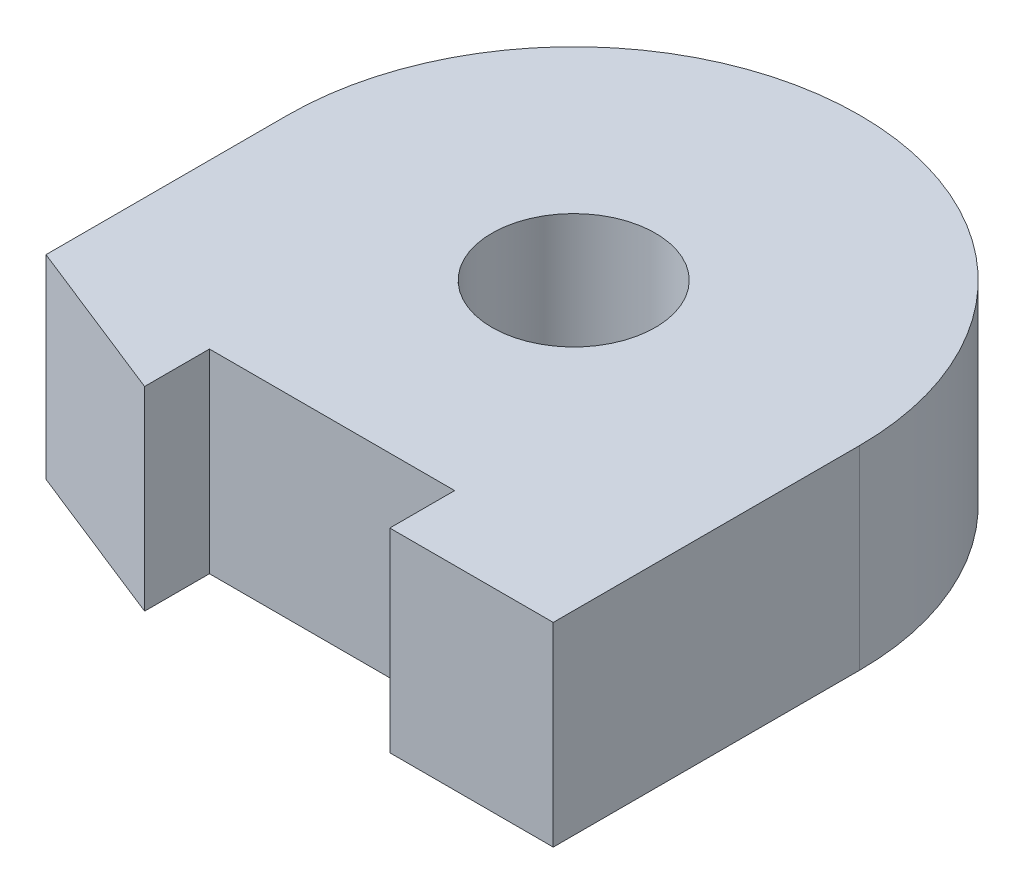
ISO-10303-21;
HEADER;
FILE_DESCRIPTION(('STEP AP214'),'2;1');
FILE_NAME('part.step','',(''),(''),'','','');
FILE_SCHEMA(('AUTOMOTIVE_DESIGN { 1 0 10303 214 1 1 1 1 }'));
ENDSEC;
DATA;
#1=APPLICATION_CONTEXT('core data for automotive mechanical design processes');
#2=APPLICATION_PROTOCOL_DEFINITION('international standard','automotive_design',2000,#1);
#3=PRODUCT_CONTEXT('',#1,'mechanical');
#4=PRODUCT('Part','Part','',(#3));
#5=PRODUCT_RELATED_PRODUCT_CATEGORY('part','',(#4));
#6=PRODUCT_DEFINITION_FORMATION('','',#4);
#7=PRODUCT_DEFINITION_CONTEXT('part definition',#1,'design');
#8=PRODUCT_DEFINITION('design','',#6,#7);
#9=PRODUCT_DEFINITION_SHAPE('','',#8);
#10=(LENGTH_UNIT() NAMED_UNIT(*) SI_UNIT(.MILLI.,.METRE.));
#11=(NAMED_UNIT(*) PLANE_ANGLE_UNIT() SI_UNIT($,.RADIAN.));
#12=(NAMED_UNIT(*) SI_UNIT($,.STERADIAN.) SOLID_ANGLE_UNIT());
#13=UNCERTAINTY_MEASURE_WITH_UNIT(LENGTH_MEASURE(1.E-05),#10,'distance_accuracy_value','');
#14=(GEOMETRIC_REPRESENTATION_CONTEXT(3) GLOBAL_UNCERTAINTY_ASSIGNED_CONTEXT((#13)) GLOBAL_UNIT_ASSIGNED_CONTEXT((#10,
#11,#12)) REPRESENTATION_CONTEXT('',''));
#15=CARTESIAN_POINT('',(0.,0.,0.));
#16=DIRECTION('',(0.,0.,1.));
#17=DIRECTION('',(1.,0.,0.));
#18=AXIS2_PLACEMENT_3D('',#15,#16,#17);
#19=CARTESIAN_POINT('',(0.,9.525,0.));
#20=DIRECTION('',(0.,0.,1.));
#21=DIRECTION('',(1.,0.,0.));
#22=AXIS2_PLACEMENT_3D('',#19,#20,#21);
#23=PLANE('',#22);
#24=DIRECTION('',(-1.,0.,0.));
#25=VECTOR('',#24,1.);
#26=CARTESIAN_POINT('',(0.,0.,0.));
#27=LINE('',#26,#25);
#28=CARTESIAN_POINT('',(6.,0.,0.));
#29=VERTEX_POINT('',#28);
#30=CARTESIAN_POINT('',(-6.,0.,0.));
#31=VERTEX_POINT('',#30);
#32=EDGE_CURVE('E136',#29,#31,#27,.T.);
#33=ORIENTED_EDGE('',*,*,#32,.F.);
#34=DIRECTION('',(0.,-1.,0.));
#35=VECTOR('',#34,1.);
#36=CARTESIAN_POINT('',(6.,9.525,0.));
#37=LINE('',#36,#35);
#38=CARTESIAN_POINT('',(6.,9.525,0.));
#39=VERTEX_POINT('',#38);
#40=EDGE_CURVE('E11',#39,#29,#37,.T.);
#41=ORIENTED_EDGE('',*,*,#40,.F.);
#42=DIRECTION('',(-1.,0.,0.));
#43=VECTOR('',#42,1.);
#44=CARTESIAN_POINT('',(0.,9.525,0.));
#45=LINE('',#44,#43);
#46=CARTESIAN_POINT('',(-6.,9.525,0.));
#47=VERTEX_POINT('',#46);
#48=EDGE_CURVE('E157',#39,#47,#45,.T.);
#49=ORIENTED_EDGE('',*,*,#48,.T.);
#50=DIRECTION('',(0.,-1.,0.));
#51=VECTOR('',#50,1.);
#52=CARTESIAN_POINT('',(-6.,9.525,0.));
#53=LINE('',#52,#51);
#54=EDGE_CURVE('E55',#47,#31,#53,.T.);
#55=ORIENTED_EDGE('',*,*,#54,.T.);
#56=EDGE_LOOP('',(#33,#41,#49,#55));
#57=FACE_BOUND('',#56,.T.);
#58=ADVANCED_FACE('F39',(#57),#23,.T.);
#59=CARTESIAN_POINT('',(6.,9.525,0.));
#60=DIRECTION('',(1.,0.,0.));
#61=DIRECTION('',(0.,0.,-1.));
#62=AXIS2_PLACEMENT_3D('',#59,#60,#61);
#63=PLANE('',#62);
#64=DIRECTION('',(0.,0.,1.));
#65=VECTOR('',#64,1.);
#66=CARTESIAN_POINT('',(6.,0.,0.));
#67=LINE('',#66,#65);
#68=CARTESIAN_POINT('',(6.,0.,3.175));
#69=VERTEX_POINT('',#68);
#70=EDGE_CURVE('E138',#29,#69,#67,.T.);
#71=ORIENTED_EDGE('',*,*,#70,.T.);
#72=DIRECTION('',(0.,-1.,0.));
#73=VECTOR('',#72,1.);
#74=CARTESIAN_POINT('',(6.,9.525,3.175));
#75=LINE('',#74,#73);
#76=CARTESIAN_POINT('',(6.,9.525,3.175));
#77=VERTEX_POINT('',#76);
#78=EDGE_CURVE('E47',#77,#69,#75,.T.);
#79=ORIENTED_EDGE('',*,*,#78,.F.);
#80=DIRECTION('',(0.,0.,1.));
#81=VECTOR('',#80,1.);
#82=CARTESIAN_POINT('',(6.,9.525,0.));
#83=LINE('',#82,#81);
#84=EDGE_CURVE('E186',#39,#77,#83,.T.);
#85=ORIENTED_EDGE('',*,*,#84,.F.);
#86=ORIENTED_EDGE('',*,*,#40,.T.);
#87=EDGE_LOOP('',(#71,#79,#85,#86));
#88=FACE_BOUND('',#87,.T.);
#89=ADVANCED_FACE('F202',(#88),#63,.F.);
#90=CARTESIAN_POINT('',(0.,9.525,3.175));
#91=DIRECTION('',(0.,0.,-1.));
#92=DIRECTION('',(-1.,0.,0.));
#93=AXIS2_PLACEMENT_3D('',#90,#91,#92);
#94=PLANE('',#93);
#95=DIRECTION('',(1.,0.,0.));
#96=VECTOR('',#95,1.);
#97=CARTESIAN_POINT('',(0.,0.,3.175));
#98=LINE('',#97,#96);
#99=CARTESIAN_POINT('',(14.,0.,3.175));
#100=VERTEX_POINT('',#99);
#101=EDGE_CURVE('E140',#69,#100,#98,.T.);
#102=ORIENTED_EDGE('',*,*,#101,.T.);
#103=DIRECTION('',(0.,-1.,0.));
#104=VECTOR('',#103,1.);
#105=CARTESIAN_POINT('',(14.,9.525,3.175));
#106=LINE('',#105,#104);
#107=CARTESIAN_POINT('',(14.,9.525,3.175));
#108=VERTEX_POINT('',#107);
#109=EDGE_CURVE('E163',#108,#100,#106,.T.);
#110=ORIENTED_EDGE('',*,*,#109,.F.);
#111=DIRECTION('',(1.,0.,0.));
#112=VECTOR('',#111,1.);
#113=CARTESIAN_POINT('',(0.,9.525,3.175));
#114=LINE('',#113,#112);
#115=EDGE_CURVE('E172',#77,#108,#114,.T.);
#116=ORIENTED_EDGE('',*,*,#115,.F.);
#117=ORIENTED_EDGE('',*,*,#78,.T.);
#118=EDGE_LOOP('',(#102,#110,#116,#117));
#119=FACE_BOUND('',#118,.T.);
#120=ADVANCED_FACE('F170',(#119),#94,.F.);
#121=CARTESIAN_POINT('',(14.,9.525,0.));
#122=DIRECTION('',(-1.,0.,0.));
#123=DIRECTION('',(0.,0.,1.));
#124=AXIS2_PLACEMENT_3D('',#121,#122,#123);
#125=PLANE('',#124);
#126=DIRECTION('',(0.,0.,-1.));
#127=VECTOR('',#126,1.);
#128=CARTESIAN_POINT('',(14.,0.,0.));
#129=LINE('',#128,#127);
#130=CARTESIAN_POINT('',(14.,0.,-11.825));
#131=VERTEX_POINT('',#130);
#132=EDGE_CURVE('E142',#100,#131,#129,.T.);
#133=ORIENTED_EDGE('',*,*,#132,.T.);
#134=DIRECTION('',(0.,-1.,0.));
#135=VECTOR('',#134,1.);
#136=CARTESIAN_POINT('',(14.,9.525,-11.825));
#137=LINE('',#136,#135);
#138=CARTESIAN_POINT('',(14.,9.525,-11.825));
#139=VERTEX_POINT('',#138);
#140=EDGE_CURVE('E161',#139,#131,#137,.T.);
#141=ORIENTED_EDGE('',*,*,#140,.F.);
#142=DIRECTION('',(0.,0.,-1.));
#143=VECTOR('',#142,1.);
#144=CARTESIAN_POINT('',(14.,9.525,0.));
#145=LINE('',#144,#143);
#146=EDGE_CURVE('E184',#108,#139,#145,.T.);
#147=ORIENTED_EDGE('',*,*,#146,.F.);
#148=ORIENTED_EDGE('',*,*,#109,.T.);
#149=EDGE_LOOP('',(#133,#141,#147,#148));
#150=FACE_BOUND('',#149,.T.);
#151=ADVANCED_FACE('F182',(#150),#125,.F.);
#152=CARTESIAN_POINT('',(0.,9.525,-11.825));
#153=DIRECTION('',(0.,-1.,0.));
#154=DIRECTION('',(0.,0.,-1.));
#155=AXIS2_PLACEMENT_3D('',#152,#153,#154);
#156=CYLINDRICAL_SURFACE('',#155,14.);
#157=CARTESIAN_POINT('',(0.,0.,-11.825));
#158=DIRECTION('',(0.,1.,0.));
#159=DIRECTION('',(0.,0.,1.));
#160=AXIS2_PLACEMENT_3D('',#157,#158,#159);
#161=CIRCLE('',#160,14.);
#162=CARTESIAN_POINT('',(-14.,0.,-11.825));
#163=VERTEX_POINT('',#162);
#164=EDGE_CURVE('E145',#163,#131,#161,.F.);
#165=ORIENTED_EDGE('',*,*,#164,.F.);
#166=DIRECTION('',(0.,-1.,0.));
#167=VECTOR('',#166,1.);
#168=CARTESIAN_POINT('',(-14.,9.525,-11.825));
#169=LINE('',#168,#167);
#170=CARTESIAN_POINT('',(-14.,9.525,-11.825));
#171=VERTEX_POINT('',#170);
#172=EDGE_CURVE('E114',#171,#163,#169,.T.);
#173=ORIENTED_EDGE('',*,*,#172,.F.);
#174=CARTESIAN_POINT('',(0.,9.525,-11.825));
#175=DIRECTION('',(0.,1.,0.));
#176=DIRECTION('',(0.,0.,1.));
#177=AXIS2_PLACEMENT_3D('',#174,#175,#176);
#178=CIRCLE('',#177,14.);
#179=EDGE_CURVE('E125',#171,#139,#178,.F.);
#180=ORIENTED_EDGE('',*,*,#179,.T.);
#181=ORIENTED_EDGE('',*,*,#140,.T.);
#182=EDGE_LOOP('',(#165,#173,#180,#181));
#183=FACE_BOUND('',#182,.T.);
#184=ADVANCED_FACE('F213',(#183),#156,.T.);
#185=CARTESIAN_POINT('',(-14.,9.525,0.));
#186=DIRECTION('',(-1.,0.,0.));
#187=DIRECTION('',(0.,0.,1.));
#188=AXIS2_PLACEMENT_3D('',#185,#186,#187);
#189=PLANE('',#188);
#190=DIRECTION('',(0.,0.,-1.));
#191=VECTOR('',#190,1.);
#192=CARTESIAN_POINT('',(-14.,0.,0.));
#193=LINE('',#192,#191);
#194=CARTESIAN_POINT('',(-14.,0.,0.));
#195=VERTEX_POINT('',#194);
#196=EDGE_CURVE('E110',#195,#163,#193,.T.);
#197=ORIENTED_EDGE('',*,*,#196,.F.);
#198=DIRECTION('',(0.,-1.,0.));
#199=VECTOR('',#198,1.);
#200=CARTESIAN_POINT('',(-14.,9.525,0.));
#201=LINE('',#200,#199);
#202=CARTESIAN_POINT('',(-14.,9.525,0.));
#203=VERTEX_POINT('',#202);
#204=EDGE_CURVE('E105',#203,#195,#201,.T.);
#205=ORIENTED_EDGE('',*,*,#204,.F.);
#206=DIRECTION('',(0.,0.,-1.));
#207=VECTOR('',#206,1.);
#208=CARTESIAN_POINT('',(-14.,9.525,0.));
#209=LINE('',#208,#207);
#210=EDGE_CURVE('E108',#203,#171,#209,.T.);
#211=ORIENTED_EDGE('',*,*,#210,.T.);
#212=ORIENTED_EDGE('',*,*,#172,.T.);
#213=EDGE_LOOP('',(#197,#205,#211,#212));
#214=FACE_BOUND('',#213,.T.);
#215=ADVANCED_FACE('F107',(#214),#189,.T.);
#216=CARTESIAN_POINT('',(-1.90506964540324,9.525,4.80017548448059));
#217=DIRECTION('',(-0.368885352437703,0.,0.929474903780038));
#218=DIRECTION('',(0.929474903780039,0.,0.368885352437703));
#219=AXIS2_PLACEMENT_3D('',#216,#217,#218);
#220=PLANE('',#219);
#221=DIRECTION('',(-0.929474903780039,0.,-0.368885352437703));
#222=VECTOR('',#221,1.);
#223=CARTESIAN_POINT('',(-1.90506964540324,0.,4.80017548448059));
#224=LINE('',#223,#222);
#225=CARTESIAN_POINT('',(-6.,0.,3.175));
#226=VERTEX_POINT('',#225);
#227=EDGE_CURVE('E149',#226,#195,#224,.T.);
#228=ORIENTED_EDGE('',*,*,#227,.F.);
#229=DIRECTION('',(0.,-1.,0.));
#230=VECTOR('',#229,1.);
#231=CARTESIAN_POINT('',(-6.,9.525,3.175));
#232=LINE('',#231,#230);
#233=CARTESIAN_POINT('',(-6.,9.525,3.175));
#234=VERTEX_POINT('',#233);
#235=EDGE_CURVE('E80',#234,#226,#232,.T.);
#236=ORIENTED_EDGE('',*,*,#235,.F.);
#237=DIRECTION('',(-0.929474903780039,0.,-0.368885352437703));
#238=VECTOR('',#237,1.);
#239=CARTESIAN_POINT('',(-1.90506964540324,9.525,4.80017548448059));
#240=LINE('',#239,#238);
#241=EDGE_CURVE('E123',#234,#203,#240,.T.);
#242=ORIENTED_EDGE('',*,*,#241,.T.);
#243=ORIENTED_EDGE('',*,*,#204,.T.);
#244=EDGE_LOOP('',(#228,#236,#242,#243));
#245=FACE_BOUND('',#244,.T.);
#246=ADVANCED_FACE('F127',(#245),#220,.T.);
#247=CARTESIAN_POINT('',(-6.,9.525,0.));
#248=DIRECTION('',(1.,0.,0.));
#249=DIRECTION('',(0.,0.,-1.));
#250=AXIS2_PLACEMENT_3D('',#247,#248,#249);
#251=PLANE('',#250);
#252=DIRECTION('',(0.,0.,1.));
#253=VECTOR('',#252,1.);
#254=CARTESIAN_POINT('',(-6.,0.,0.));
#255=LINE('',#254,#253);
#256=EDGE_CURVE('E151',#31,#226,#255,.T.);
#257=ORIENTED_EDGE('',*,*,#256,.F.);
#258=ORIENTED_EDGE('',*,*,#54,.F.);
#259=DIRECTION('',(0.,0.,1.));
#260=VECTOR('',#259,1.);
#261=CARTESIAN_POINT('',(-6.,9.525,0.));
#262=LINE('',#261,#260);
#263=EDGE_CURVE('E128',#47,#234,#262,.T.);
#264=ORIENTED_EDGE('',*,*,#263,.T.);
#265=ORIENTED_EDGE('',*,*,#235,.T.);
#266=EDGE_LOOP('',(#257,#258,#264,#265));
#267=FACE_BOUND('',#266,.T.);
#268=ADVANCED_FACE('F190',(#267),#251,.T.);
#269=CARTESIAN_POINT('',(0.,9.525,-11.825));
#270=DIRECTION('',(0.,-1.,0.));
#271=DIRECTION('',(0.,0.,-1.));
#272=AXIS2_PLACEMENT_3D('',#269,#270,#271);
#273=CYLINDRICAL_SURFACE('',#272,4.);
#274=CARTESIAN_POINT('',(0.,9.525,-11.825));
#275=DIRECTION('',(0.,1.,0.));
#276=DIRECTION('',(0.,0.,1.));
#277=AXIS2_PLACEMENT_3D('',#274,#275,#276);
#278=CIRCLE('',#277,4.);
#279=CARTESIAN_POINT('',(0.,9.525,-7.825));
#280=VERTEX_POINT('',#279);
#281=EDGE_CURVE('E130',#280,#280,#278,.T.);
#282=ORIENTED_EDGE('',*,*,#281,.T.);
#283=EDGE_LOOP('',(#282));
#284=FACE_BOUND('',#283,.T.);
#285=CARTESIAN_POINT('',(0.,0.,-11.825));
#286=DIRECTION('',(0.,1.,0.));
#287=DIRECTION('',(0.,0.,1.));
#288=AXIS2_PLACEMENT_3D('',#285,#286,#287);
#289=CIRCLE('',#288,4.);
#290=CARTESIAN_POINT('',(0.,0.,-7.825));
#291=VERTEX_POINT('',#290);
#292=EDGE_CURVE('E154',#291,#291,#289,.T.);
#293=ORIENTED_EDGE('',*,*,#292,.F.);
#294=EDGE_LOOP('',(#293));
#295=FACE_BOUND('',#294,.T.);
#296=ADVANCED_FACE('F192',(#284,#295),#273,.F.);
#297=CARTESIAN_POINT('',(0.,9.525,0.));
#298=DIRECTION('',(0.,1.,0.));
#299=DIRECTION('',(0.,0.,1.));
#300=AXIS2_PLACEMENT_3D('',#297,#298,#299);
#301=PLANE('',#300);
#302=ORIENTED_EDGE('',*,*,#48,.F.);
#303=ORIENTED_EDGE('',*,*,#84,.T.);
#304=ORIENTED_EDGE('',*,*,#115,.T.);
#305=ORIENTED_EDGE('',*,*,#146,.T.);
#306=ORIENTED_EDGE('',*,*,#179,.F.);
#307=ORIENTED_EDGE('',*,*,#210,.F.);
#308=ORIENTED_EDGE('',*,*,#241,.F.);
#309=ORIENTED_EDGE('',*,*,#263,.F.);
#310=EDGE_LOOP('',(#302,#303,#304,#305,#306,#307,#308,#309));
#311=FACE_BOUND('',#310,.T.);
#312=ORIENTED_EDGE('',*,*,#281,.F.);
#313=EDGE_LOOP('',(#312));
#314=FACE_BOUND('',#313,.T.);
#315=ADVANCED_FACE('F120',(#311,#314),#301,.T.);
#316=CARTESIAN_POINT('',(0.,0.,0.));
#317=DIRECTION('',(0.,1.,0.));
#318=DIRECTION('',(0.,0.,1.));
#319=AXIS2_PLACEMENT_3D('',#316,#317,#318);
#320=PLANE('',#319);
#321=ORIENTED_EDGE('',*,*,#32,.T.);
#322=ORIENTED_EDGE('',*,*,#256,.T.);
#323=ORIENTED_EDGE('',*,*,#227,.T.);
#324=ORIENTED_EDGE('',*,*,#196,.T.);
#325=ORIENTED_EDGE('',*,*,#164,.T.);
#326=ORIENTED_EDGE('',*,*,#132,.F.);
#327=ORIENTED_EDGE('',*,*,#101,.F.);
#328=ORIENTED_EDGE('',*,*,#70,.F.);
#329=EDGE_LOOP('',(#321,#322,#323,#324,#325,#326,#327,#328));
#330=FACE_BOUND('',#329,.T.);
#331=ORIENTED_EDGE('',*,*,#292,.T.);
#332=EDGE_LOOP('',(#331));
#333=FACE_BOUND('',#332,.T.);
#334=ADVANCED_FACE('F177',(#330,#333),#320,.F.);
#335=CLOSED_SHELL('',(#58,#89,#120,#151,#184,#215,#246,#268,#296,#315,#334));
#336=MANIFOLD_SOLID_BREP('B2',#335);
#337=ADVANCED_BREP_SHAPE_REPRESENTATION('',(#18,#336),#14);
#338=SHAPE_DEFINITION_REPRESENTATION(#9,#337);
ENDSEC;
END-ISO-10303-21;
